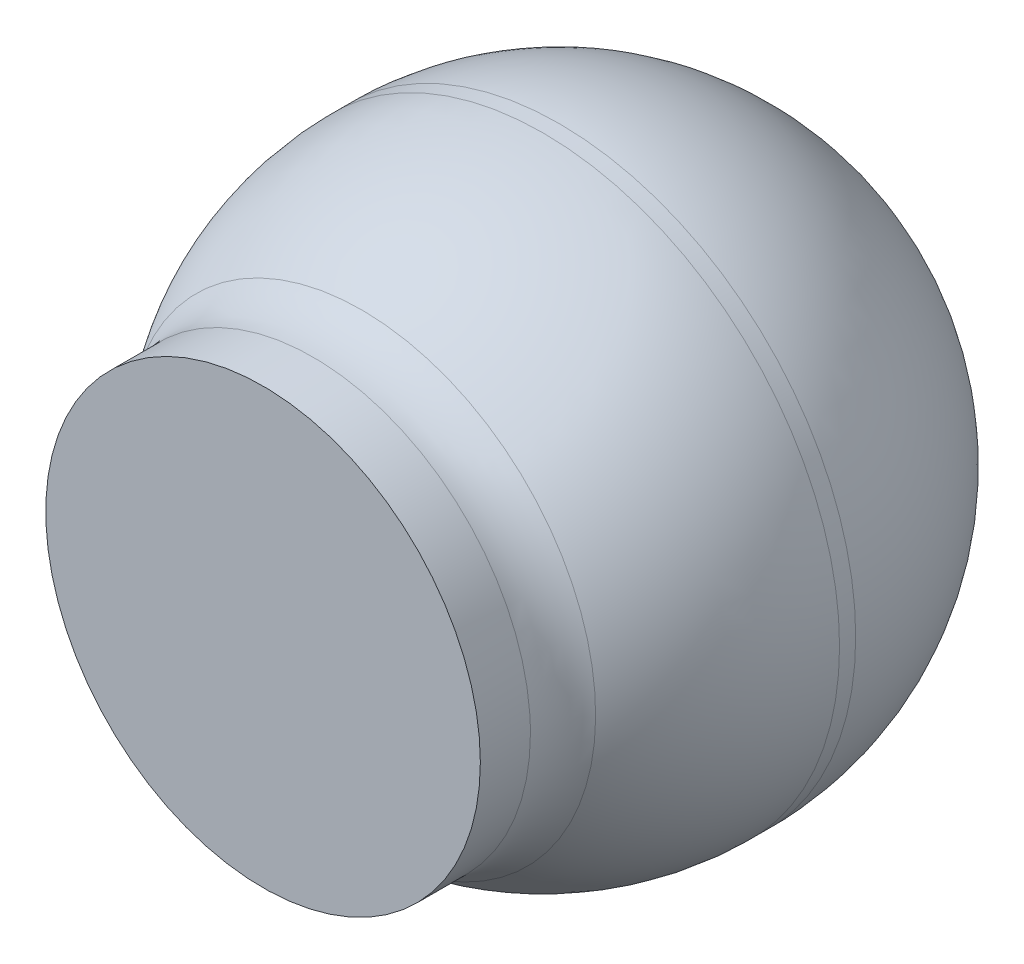
ISO-10303-21;
HEADER;
FILE_DESCRIPTION(('STEP AP214'),'2;1');
FILE_NAME('part.step','',(''),(''),'','','');
FILE_SCHEMA(('AUTOMOTIVE_DESIGN { 1 0 10303 214 1 1 1 1 }'));
ENDSEC;
DATA;
#1=APPLICATION_CONTEXT('core data for automotive mechanical design processes');
#2=APPLICATION_PROTOCOL_DEFINITION('international standard','automotive_design',2000,#1);
#3=PRODUCT_CONTEXT('',#1,'mechanical');
#4=PRODUCT('Part','Part','',(#3));
#5=PRODUCT_RELATED_PRODUCT_CATEGORY('part','',(#4));
#6=PRODUCT_DEFINITION_FORMATION('','',#4);
#7=PRODUCT_DEFINITION_CONTEXT('part definition',#1,'design');
#8=PRODUCT_DEFINITION('design','',#6,#7);
#9=PRODUCT_DEFINITION_SHAPE('','',#8);
#10=(LENGTH_UNIT() NAMED_UNIT(*) SI_UNIT(.MILLI.,.METRE.));
#11=(NAMED_UNIT(*) PLANE_ANGLE_UNIT() SI_UNIT($,.RADIAN.));
#12=(NAMED_UNIT(*) SI_UNIT($,.STERADIAN.) SOLID_ANGLE_UNIT());
#13=UNCERTAINTY_MEASURE_WITH_UNIT(LENGTH_MEASURE(1.E-05),#10,'distance_accuracy_value','');
#14=(GEOMETRIC_REPRESENTATION_CONTEXT(3) GLOBAL_UNCERTAINTY_ASSIGNED_CONTEXT((#13)) GLOBAL_UNIT_ASSIGNED_CONTEXT((#10,
#11,#12)) REPRESENTATION_CONTEXT('',''));
#15=CARTESIAN_POINT('',(0.,0.,0.));
#16=DIRECTION('',(0.,0.,1.));
#17=DIRECTION('',(1.,0.,0.));
#18=AXIS2_PLACEMENT_3D('',#15,#16,#17);
#19=CARTESIAN_POINT('',(0.707080077731,-5.321349291452,10.006534503384));
#20=DIRECTION('',(0.,0.,-1.));
#21=DIRECTION('',(-1.,0.,0.));
#22=AXIS2_PLACEMENT_3D('',#19,#20,#21);
#23=PLANE('',#22);
#24=CARTESIAN_POINT('',(0.707080077731,-5.321349291452,10.006534503384));
#25=DIRECTION('',(0.,0.,1.));
#26=DIRECTION('',(1.,0.,0.));
#27=AXIS2_PLACEMENT_3D('',#24,#25,#26);
#28=CIRCLE('',#27,0.275);
#29=CARTESIAN_POINT('',(0.982080077731,-5.321349291452,10.006534503384));
#30=VERTEX_POINT('',#29);
#31=EDGE_CURVE('E20',#30,#30,#28,.F.);
#32=ORIENTED_EDGE('',*,*,#31,.F.);
#33=EDGE_LOOP('',(#32));
#34=FACE_BOUND('',#33,.T.);
#35=ADVANCED_FACE('F17',(#34),#23,.F.);
#36=CARTESIAN_POINT('',(0.707080077731,-5.321349291452,9.906534503384));
#37=DIRECTION('',(0.,0.,1.));
#38=DIRECTION('',(1.,0.,0.));
#39=AXIS2_PLACEMENT_3D('',#36,#37,#38);
#40=CYLINDRICAL_SURFACE('',#39,0.275);
#41=CARTESIAN_POINT('',(0.707080077731,-5.321349291452,9.943180457728));
#42=DIRECTION('',(0.,0.,-1.));
#43=DIRECTION('',(0.996700902337583,0.0811622527992438,0.));
#44=AXIS2_PLACEMENT_3D('',#41,#42,#43);
#45=CIRCLE('',#44,0.275);
#46=CARTESIAN_POINT('',(0.981172825873835,-5.29902967193221,9.943180457728));
#47=VERTEX_POINT('',#46);
#48=EDGE_CURVE('E65',#47,#47,#45,.F.);
#49=ORIENTED_EDGE('',*,*,#48,.T.);
#50=EDGE_LOOP('',(#49));
#51=FACE_BOUND('',#50,.T.);
#52=ORIENTED_EDGE('',*,*,#31,.T.);
#53=EDGE_LOOP('',(#52));
#54=FACE_BOUND('',#53,.T.);
#55=ADVANCED_FACE('F62',(#51,#54),#40,.T.);
#56=CARTESIAN_POINT('',(0.707080077731,-5.321349291452,9.943180457728));
#57=DIRECTION('',(0.,0.,-1.));
#58=DIRECTION('',(0.996700902337583,0.0811622527992449,0.));
#59=AXIS2_PLACEMENT_3D('',#56,#57,#58);
#60=TOROIDAL_SURFACE('',#59,0.375,0.1);
#61=ORIENTED_EDGE('',*,*,#48,.F.);
#62=EDGE_LOOP('',(#61));
#63=FACE_BOUND('',#62,.T.);
#64=CARTESIAN_POINT('',(0.707080077731001,-5.321349291452,9.881744931236));
#65=DIRECTION('',(0.,0.,-1.));
#66=DIRECTION('',(-0.996700902337598,-0.0811622527990622,0.));
#67=AXIS2_PLACEMENT_3D('',#64,#65,#66);
#68=CIRCLE('',#67,0.296097046412665);
#69=CARTESIAN_POINT('',(0.411959884392,-5.345381194786,9.881744931236));
#70=VERTEX_POINT('',#69);
#71=EDGE_CURVE('E39',#70,#70,#68,.T.);
#72=ORIENTED_EDGE('',*,*,#71,.F.);
#73=EDGE_LOOP('',(#72));
#74=FACE_BOUND('',#73,.T.);
#75=ADVANCED_FACE('F57',(#63,#74),#60,.F.);
#76=CARTESIAN_POINT('',(0.333317239355,-5.351785136252,9.651976062157));
#77=CARTESIAN_POINT('',(0.333317239355,-5.351785136252,9.701461392103));
#78=CARTESIAN_POINT('',(0.341473782652,-5.351120941579,9.750947004335));
#79=CARTESIAN_POINT('',(0.357792914651,-5.349792059952,9.798626332798));
#80=CARTESIAN_POINT('',(0.381658609162,-5.347848654938,9.842699544317));
#81=CARTESIAN_POINT('',(0.411959884392,-5.345381194786,9.881744931236));
#82=(BOUNDED_CURVE() B_SPLINE_CURVE(5,(#76,#77,#78,#79,#80,#81),.UNSPECIFIED.,.F.,
.F.) B_SPLINE_CURVE_WITH_KNOTS((6,6),(0.,0.661568582165),
.UNSPECIFIED.) CURVE() GEOMETRIC_REPRESENTATION_ITEM() RATIONAL_B_SPLINE_CURVE((1.,1.,1.,1.,1.,1.)) REPRESENTATION_ITEM(''));
#83=CARTESIAN_POINT('',(0.707080077731,-5.321349291452,9.651976062157));
#84=DIRECTION('',(0.,0.,-1.));
#85=AXIS1_PLACEMENT('',#83,#84);
#86=SURFACE_OF_REVOLUTION('',#82,#85);
#87=CARTESIAN_POINT('',(0.707080077731001,-5.321349291452,9.651976062157));
#88=DIRECTION('',(0.,0.,1.));
#89=DIRECTION('',(1.,0.,0.));
#90=AXIS2_PLACEMENT_3D('',#87,#88,#89);
#91=CIRCLE('',#90,0.375);
#92=CARTESIAN_POINT('',(1.082080077731,-5.321349291452,9.651976062157));
#93=VERTEX_POINT('',#92);
#94=EDGE_CURVE('E36',#93,#93,#91,.F.);
#95=ORIENTED_EDGE('',*,*,#94,.F.);
#96=EDGE_LOOP('',(#95));
#97=FACE_BOUND('',#96,.T.);
#98=ORIENTED_EDGE('',*,*,#71,.T.);
#99=EDGE_LOOP('',(#98));
#100=FACE_BOUND('',#99,.T.);
#101=ADVANCED_FACE('F53',(#97,#100),#86,.F.);
#102=CARTESIAN_POINT('',(0.707080077731,-5.321349291452,9.256534503384));
#103=DIRECTION('',(0.,0.,1.));
#104=DIRECTION('',(1.,0.,0.));
#105=AXIS2_PLACEMENT_3D('',#102,#103,#104);
#106=CYLINDRICAL_SURFACE('',#105,0.375);
#107=CARTESIAN_POINT('',(0.707080077731,-5.321349291452,9.631534503384));
#108=DIRECTION('',(0.,0.,-1.));
#109=DIRECTION('',(0.0811622527992362,-0.996700902337583,0.));
#110=AXIS2_PLACEMENT_3D('',#107,#108,#109);
#111=CIRCLE('',#110,0.375);
#112=CARTESIAN_POINT('',(0.737515922530713,-5.69511212982859,9.631534503384));
#113=VERTEX_POINT('',#112);
#114=CARTESIAN_POINT('',(0.676644232931287,-4.94758645307541,9.631534503384));
#115=VERTEX_POINT('',#114);
#116=EDGE_CURVE('E11',#113,#115,#111,.T.);
#117=ORIENTED_EDGE('',*,*,#116,.F.);
#118=CARTESIAN_POINT('',(0.707080077731,-5.321349291452,9.631534503384));
#119=DIRECTION('',(0.,0.,1.));
#120=DIRECTION('',(0.0811622527992359,-0.996700902337583,0.));
#121=AXIS2_PLACEMENT_3D('',#118,#119,#120);
#122=CIRCLE('',#121,0.375);
#123=EDGE_CURVE('E25',#115,#113,#122,.F.);
#124=ORIENTED_EDGE('',*,*,#123,.F.);
#125=EDGE_LOOP('',(#117,#124));
#126=FACE_BOUND('',#125,.T.);
#127=ORIENTED_EDGE('',*,*,#94,.T.);
#128=EDGE_LOOP('',(#127));
#129=FACE_BOUND('',#128,.T.);
#130=ADVANCED_FACE('F34',(#126,#129),#106,.T.);
#131=CARTESIAN_POINT('',(0.707080077731,-5.321349291452,9.631534503384));
#132=DIRECTION('',(0.0811622527992361,-0.996700902337583,0.));
#133=DIRECTION('',(-0.996700902337583,-0.0811622527992361,0.));
#134=AXIS2_PLACEMENT_3D('',#131,#132,#133);
#135=SPHERICAL_SURFACE('',#134,0.375);
#136=ORIENTED_EDGE('',*,*,#123,.T.);
#137=ORIENTED_EDGE('',*,*,#116,.T.);
#138=EDGE_LOOP('',(#136,#137));
#139=FACE_BOUND('',#138,.T.);
#140=ADVANCED_FACE('F32',(#139),#135,.T.);
#141=CLOSED_SHELL('',(#35,#55,#75,#101,#130,#140));
#142=MANIFOLD_SOLID_BREP('B1',#141);
#143=ADVANCED_BREP_SHAPE_REPRESENTATION('',(#18,#142),#14);
#144=SHAPE_DEFINITION_REPRESENTATION(#9,#143);
ENDSEC;
END-ISO-10303-21;
